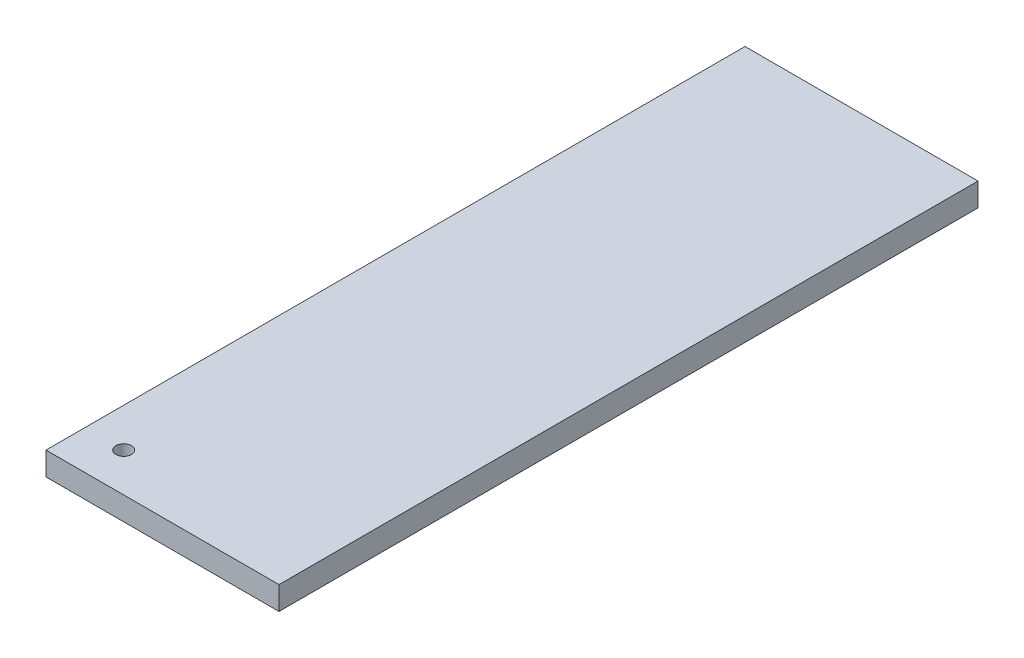
ISO-10303-21;
HEADER;
FILE_DESCRIPTION(('STEP AP214'),'2;1');
FILE_NAME('part.step','',(''),(''),'','','');
FILE_SCHEMA(('AUTOMOTIVE_DESIGN { 1 0 10303 214 1 1 1 1 }'));
ENDSEC;
DATA;
#1=APPLICATION_CONTEXT('core data for automotive mechanical design processes');
#2=APPLICATION_PROTOCOL_DEFINITION('international standard','automotive_design',2000,#1);
#3=PRODUCT_CONTEXT('',#1,'mechanical');
#4=PRODUCT('Part','Part','',(#3));
#5=PRODUCT_RELATED_PRODUCT_CATEGORY('part','',(#4));
#6=PRODUCT_DEFINITION_FORMATION('','',#4);
#7=PRODUCT_DEFINITION_CONTEXT('part definition',#1,'design');
#8=PRODUCT_DEFINITION('design','',#6,#7);
#9=PRODUCT_DEFINITION_SHAPE('','',#8);
#10=(LENGTH_UNIT() NAMED_UNIT(*) SI_UNIT(.MILLI.,.METRE.));
#11=(NAMED_UNIT(*) PLANE_ANGLE_UNIT() SI_UNIT($,.RADIAN.));
#12=(NAMED_UNIT(*) SI_UNIT($,.STERADIAN.) SOLID_ANGLE_UNIT());
#13=UNCERTAINTY_MEASURE_WITH_UNIT(LENGTH_MEASURE(1.E-05),#10,'distance_accuracy_value','');
#14=(GEOMETRIC_REPRESENTATION_CONTEXT(3) GLOBAL_UNCERTAINTY_ASSIGNED_CONTEXT((#13)) GLOBAL_UNIT_ASSIGNED_CONTEXT((#10,
#11,#12)) REPRESENTATION_CONTEXT('',''));
#15=CARTESIAN_POINT('',(0.,0.,0.));
#16=DIRECTION('',(0.,0.,1.));
#17=DIRECTION('',(1.,0.,0.));
#18=AXIS2_PLACEMENT_3D('',#15,#16,#17);
#19=CARTESIAN_POINT('',(0.,3.,0.));
#20=DIRECTION('',(0.,-1.,0.));
#21=DIRECTION('',(0.,0.,-1.));
#22=AXIS2_PLACEMENT_3D('',#19,#20,#21);
#23=PLANE('',#22);
#24=DIRECTION('',(0.,0.,1.));
#25=VECTOR('',#24,1.);
#26=CARTESIAN_POINT('',(0.,3.,0.));
#27=LINE('',#26,#25);
#28=CARTESIAN_POINT('',(0.,3.,-90.));
#29=VERTEX_POINT('',#28);
#30=CARTESIAN_POINT('',(0.,3.,0.));
#31=VERTEX_POINT('',#30);
#32=EDGE_CURVE('E92',#29,#31,#27,.T.);
#33=ORIENTED_EDGE('',*,*,#32,.T.);
#34=DIRECTION('',(1.,0.,0.));
#35=VECTOR('',#34,1.);
#36=CARTESIAN_POINT('',(0.,3.,0.));
#37=LINE('',#36,#35);
#38=CARTESIAN_POINT('',(30.,3.,0.));
#39=VERTEX_POINT('',#38);
#40=EDGE_CURVE('E87',#31,#39,#37,.T.);
#41=ORIENTED_EDGE('',*,*,#40,.T.);
#42=DIRECTION('',(0.,0.,-1.));
#43=VECTOR('',#42,1.);
#44=CARTESIAN_POINT('',(30.,3.,0.));
#45=LINE('',#44,#43);
#46=CARTESIAN_POINT('',(30.,3.,-90.));
#47=VERTEX_POINT('',#46);
#48=EDGE_CURVE('E90',#39,#47,#45,.T.);
#49=ORIENTED_EDGE('',*,*,#48,.T.);
#50=DIRECTION('',(-1.,0.,0.));
#51=VECTOR('',#50,1.);
#52=CARTESIAN_POINT('',(0.,3.,-90.));
#53=LINE('',#52,#51);
#54=EDGE_CURVE('E57',#47,#29,#53,.T.);
#55=ORIENTED_EDGE('',*,*,#54,.T.);
#56=EDGE_LOOP('',(#33,#41,#49,#55));
#57=FACE_BOUND('',#56,.T.);
#58=CARTESIAN_POINT('',(5.,3.,-5.));
#59=DIRECTION('',(0.,1.,0.));
#60=DIRECTION('',(0.,0.,1.));
#61=AXIS2_PLACEMENT_3D('',#58,#59,#60);
#62=CIRCLE('',#61,1.);
#63=CARTESIAN_POINT('',(5.,3.,-4.));
#64=VERTEX_POINT('',#63);
#65=EDGE_CURVE('E112',#64,#64,#62,.T.);
#66=ORIENTED_EDGE('',*,*,#65,.F.);
#67=EDGE_LOOP('',(#66));
#68=FACE_BOUND('',#67,.T.);
#69=ADVANCED_FACE('F39',(#57,#68),#23,.F.);
#70=CARTESIAN_POINT('',(0.,0.,0.));
#71=DIRECTION('',(0.,-1.,0.));
#72=DIRECTION('',(0.,0.,-1.));
#73=AXIS2_PLACEMENT_3D('',#70,#71,#72);
#74=PLANE('',#73);
#75=DIRECTION('',(0.,0.,1.));
#76=VECTOR('',#75,1.);
#77=CARTESIAN_POINT('',(0.,0.,0.));
#78=LINE('',#77,#76);
#79=CARTESIAN_POINT('',(0.,0.,-90.));
#80=VERTEX_POINT('',#79);
#81=CARTESIAN_POINT('',(0.,0.,0.));
#82=VERTEX_POINT('',#81);
#83=EDGE_CURVE('E108',#80,#82,#78,.T.);
#84=ORIENTED_EDGE('',*,*,#83,.F.);
#85=DIRECTION('',(-1.,0.,0.));
#86=VECTOR('',#85,1.);
#87=CARTESIAN_POINT('',(0.,0.,-90.));
#88=LINE('',#87,#86);
#89=CARTESIAN_POINT('',(30.,0.,-90.));
#90=VERTEX_POINT('',#89);
#91=EDGE_CURVE('E80',#90,#80,#88,.T.);
#92=ORIENTED_EDGE('',*,*,#91,.F.);
#93=DIRECTION('',(0.,0.,-1.));
#94=VECTOR('',#93,1.);
#95=CARTESIAN_POINT('',(30.,0.,0.));
#96=LINE('',#95,#94);
#97=CARTESIAN_POINT('',(30.,0.,0.));
#98=VERTEX_POINT('',#97);
#99=EDGE_CURVE('E74',#98,#90,#96,.T.);
#100=ORIENTED_EDGE('',*,*,#99,.F.);
#101=DIRECTION('',(1.,0.,0.));
#102=VECTOR('',#101,1.);
#103=CARTESIAN_POINT('',(0.,0.,0.));
#104=LINE('',#103,#102);
#105=EDGE_CURVE('E97',#82,#98,#104,.T.);
#106=ORIENTED_EDGE('',*,*,#105,.F.);
#107=EDGE_LOOP('',(#84,#92,#100,#106));
#108=FACE_BOUND('',#107,.T.);
#109=CARTESIAN_POINT('',(5.,0.,-5.));
#110=DIRECTION('',(0.,1.,0.));
#111=DIRECTION('',(0.,0.,1.));
#112=AXIS2_PLACEMENT_3D('',#109,#110,#111);
#113=CIRCLE('',#112,1.);
#114=CARTESIAN_POINT('',(5.,0.,-4.));
#115=VERTEX_POINT('',#114);
#116=EDGE_CURVE('E130',#115,#115,#113,.T.);
#117=ORIENTED_EDGE('',*,*,#116,.T.);
#118=EDGE_LOOP('',(#117));
#119=FACE_BOUND('',#118,.T.);
#120=ADVANCED_FACE('F125',(#108,#119),#74,.T.);
#121=CARTESIAN_POINT('',(0.,3.,0.));
#122=DIRECTION('',(1.,0.,0.));
#123=DIRECTION('',(0.,0.,-1.));
#124=AXIS2_PLACEMENT_3D('',#121,#122,#123);
#125=PLANE('',#124);
#126=ORIENTED_EDGE('',*,*,#83,.T.);
#127=DIRECTION('',(0.,-1.,0.));
#128=VECTOR('',#127,1.);
#129=CARTESIAN_POINT('',(0.,3.,0.));
#130=LINE('',#129,#128);
#131=EDGE_CURVE('E11',#31,#82,#130,.T.);
#132=ORIENTED_EDGE('',*,*,#131,.F.);
#133=ORIENTED_EDGE('',*,*,#32,.F.);
#134=DIRECTION('',(0.,-1.,0.));
#135=VECTOR('',#134,1.);
#136=CARTESIAN_POINT('',(0.,3.,-90.));
#137=LINE('',#136,#135);
#138=EDGE_CURVE('E104',#29,#80,#137,.T.);
#139=ORIENTED_EDGE('',*,*,#138,.T.);
#140=EDGE_LOOP('',(#126,#132,#133,#139));
#141=FACE_BOUND('',#140,.T.);
#142=ADVANCED_FACE('F41',(#141),#125,.F.);
#143=CARTESIAN_POINT('',(0.,3.,0.));
#144=DIRECTION('',(0.,0.,-1.));
#145=DIRECTION('',(-1.,0.,0.));
#146=AXIS2_PLACEMENT_3D('',#143,#144,#145);
#147=PLANE('',#146);
#148=ORIENTED_EDGE('',*,*,#105,.T.);
#149=DIRECTION('',(0.,-1.,0.));
#150=VECTOR('',#149,1.);
#151=CARTESIAN_POINT('',(30.,3.,0.));
#152=LINE('',#151,#150);
#153=EDGE_CURVE('E49',#39,#98,#152,.T.);
#154=ORIENTED_EDGE('',*,*,#153,.F.);
#155=ORIENTED_EDGE('',*,*,#40,.F.);
#156=ORIENTED_EDGE('',*,*,#131,.T.);
#157=EDGE_LOOP('',(#148,#154,#155,#156));
#158=FACE_BOUND('',#157,.T.);
#159=ADVANCED_FACE('F96',(#158),#147,.F.);
#160=CARTESIAN_POINT('',(30.,3.,0.));
#161=DIRECTION('',(-1.,0.,0.));
#162=DIRECTION('',(0.,0.,1.));
#163=AXIS2_PLACEMENT_3D('',#160,#161,#162);
#164=PLANE('',#163);
#165=ORIENTED_EDGE('',*,*,#99,.T.);
#166=DIRECTION('',(0.,-1.,0.));
#167=VECTOR('',#166,1.);
#168=CARTESIAN_POINT('',(30.,3.,-90.));
#169=LINE('',#168,#167);
#170=EDGE_CURVE('E99',#47,#90,#169,.T.);
#171=ORIENTED_EDGE('',*,*,#170,.F.);
#172=ORIENTED_EDGE('',*,*,#48,.F.);
#173=ORIENTED_EDGE('',*,*,#153,.T.);
#174=EDGE_LOOP('',(#165,#171,#172,#173));
#175=FACE_BOUND('',#174,.T.);
#176=ADVANCED_FACE('F100',(#175),#164,.F.);
#177=CARTESIAN_POINT('',(0.,3.,-90.));
#178=DIRECTION('',(0.,0.,1.));
#179=DIRECTION('',(1.,0.,0.));
#180=AXIS2_PLACEMENT_3D('',#177,#178,#179);
#181=PLANE('',#180);
#182=ORIENTED_EDGE('',*,*,#91,.T.);
#183=ORIENTED_EDGE('',*,*,#138,.F.);
#184=ORIENTED_EDGE('',*,*,#54,.F.);
#185=ORIENTED_EDGE('',*,*,#170,.T.);
#186=EDGE_LOOP('',(#182,#183,#184,#185));
#187=FACE_BOUND('',#186,.T.);
#188=ADVANCED_FACE('F122',(#187),#181,.F.);
#189=CARTESIAN_POINT('',(5.,3.,-5.));
#190=DIRECTION('',(0.,-1.,0.));
#191=DIRECTION('',(0.,0.,-1.));
#192=AXIS2_PLACEMENT_3D('',#189,#190,#191);
#193=CYLINDRICAL_SURFACE('',#192,1.);
#194=ORIENTED_EDGE('',*,*,#65,.T.);
#195=EDGE_LOOP('',(#194));
#196=FACE_BOUND('',#195,.T.);
#197=ORIENTED_EDGE('',*,*,#116,.F.);
#198=EDGE_LOOP('',(#197));
#199=FACE_BOUND('',#198,.T.);
#200=ADVANCED_FACE('F138',(#196,#199),#193,.F.);
#201=CLOSED_SHELL('',(#69,#120,#142,#159,#176,#188,#200));
#202=MANIFOLD_SOLID_BREP('B2',#201);
#203=ADVANCED_BREP_SHAPE_REPRESENTATION('',(#18,#202),#14);
#204=SHAPE_DEFINITION_REPRESENTATION(#9,#203);
ENDSEC;
END-ISO-10303-21;
